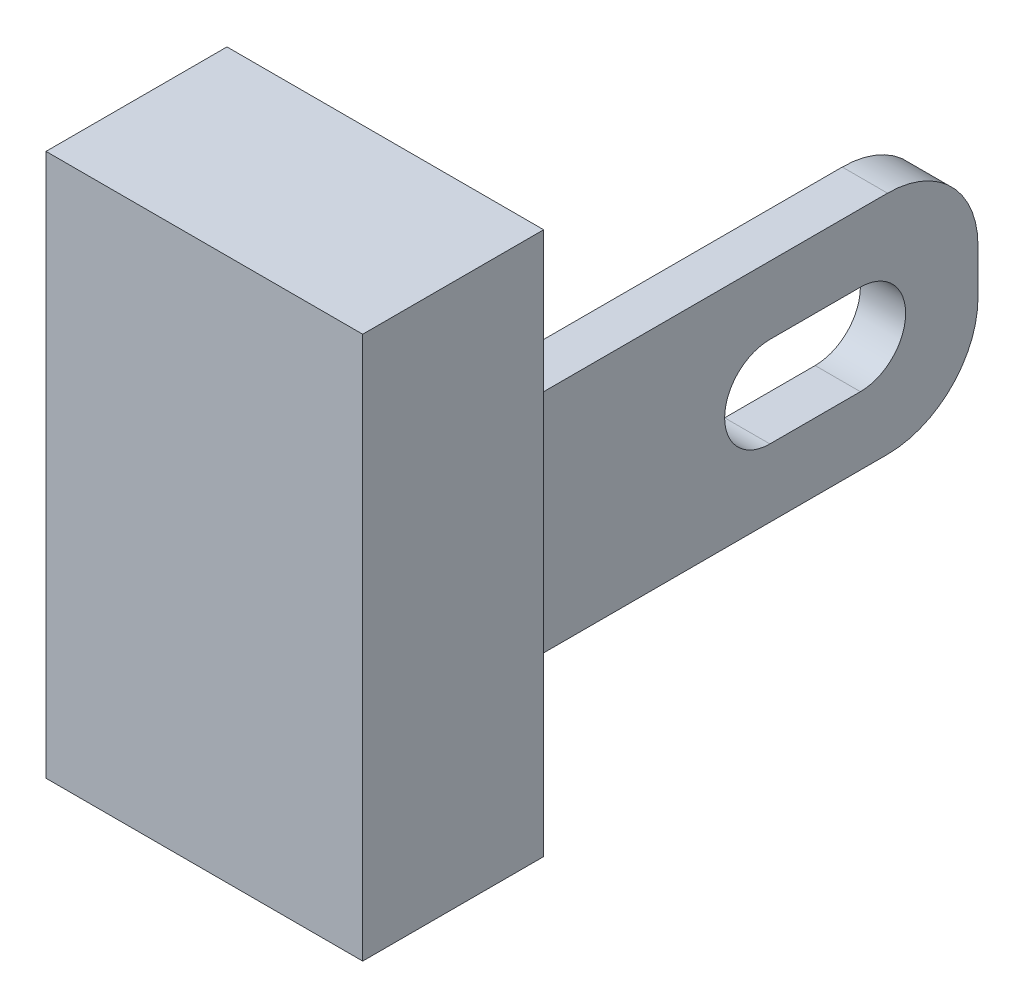
ISO-10303-21;
HEADER;
FILE_DESCRIPTION(('STEP AP214'),'2;1');
FILE_NAME('part.step','',(''),(''),'','','');
FILE_SCHEMA(('AUTOMOTIVE_DESIGN { 1 0 10303 214 1 1 1 1 }'));
ENDSEC;
DATA;
#1=APPLICATION_CONTEXT('core data for automotive mechanical design processes');
#2=APPLICATION_PROTOCOL_DEFINITION('international standard','automotive_design',2000,#1);
#3=PRODUCT_CONTEXT('',#1,'mechanical');
#4=PRODUCT('Part','Part','',(#3));
#5=PRODUCT_RELATED_PRODUCT_CATEGORY('part','',(#4));
#6=PRODUCT_DEFINITION_FORMATION('','',#4);
#7=PRODUCT_DEFINITION_CONTEXT('part definition',#1,'design');
#8=PRODUCT_DEFINITION('design','',#6,#7);
#9=PRODUCT_DEFINITION_SHAPE('','',#8);
#10=(LENGTH_UNIT() NAMED_UNIT(*) SI_UNIT(.MILLI.,.METRE.));
#11=(NAMED_UNIT(*) PLANE_ANGLE_UNIT() SI_UNIT($,.RADIAN.));
#12=(NAMED_UNIT(*) SI_UNIT($,.STERADIAN.) SOLID_ANGLE_UNIT());
#13=UNCERTAINTY_MEASURE_WITH_UNIT(LENGTH_MEASURE(1.E-05),#10,'distance_accuracy_value','');
#14=(GEOMETRIC_REPRESENTATION_CONTEXT(3) GLOBAL_UNCERTAINTY_ASSIGNED_CONTEXT((#13)) GLOBAL_UNIT_ASSIGNED_CONTEXT((#10,
#11,#12)) REPRESENTATION_CONTEXT('',''));
#15=CARTESIAN_POINT('',(0.,0.,0.));
#16=DIRECTION('',(0.,0.,1.));
#17=DIRECTION('',(1.,0.,0.));
#18=AXIS2_PLACEMENT_3D('',#15,#16,#17);
#19=CARTESIAN_POINT('',(0.,0.,0.));
#20=DIRECTION('',(0.,0.,1.));
#21=DIRECTION('',(1.,0.,0.));
#22=AXIS2_PLACEMENT_3D('',#19,#20,#21);
#23=PLANE('',#22);
#24=DIRECTION('',(0.,1.,0.));
#25=VECTOR('',#24,1.);
#26=CARTESIAN_POINT('',(1.75,3.,0.));
#27=LINE('',#26,#25);
#28=CARTESIAN_POINT('',(1.75,-3.,0.));
#29=VERTEX_POINT('',#28);
#30=CARTESIAN_POINT('',(1.75,3.,0.));
#31=VERTEX_POINT('',#30);
#32=EDGE_CURVE('E200',#29,#31,#27,.T.);
#33=ORIENTED_EDGE('',*,*,#32,.F.);
#34=DIRECTION('',(1.,0.,0.));
#35=VECTOR('',#34,1.);
#36=CARTESIAN_POINT('',(-1.75,-3.,0.));
#37=LINE('',#36,#35);
#38=CARTESIAN_POINT('',(-1.75,-3.,0.));
#39=VERTEX_POINT('',#38);
#40=EDGE_CURVE('E205',#39,#29,#37,.T.);
#41=ORIENTED_EDGE('',*,*,#40,.F.);
#42=DIRECTION('',(0.,-1.,0.));
#43=VECTOR('',#42,1.);
#44=CARTESIAN_POINT('',(-1.75,3.,0.));
#45=LINE('',#44,#43);
#46=CARTESIAN_POINT('',(-1.75,3.,0.));
#47=VERTEX_POINT('',#46);
#48=EDGE_CURVE('E216',#47,#39,#45,.T.);
#49=ORIENTED_EDGE('',*,*,#48,.F.);
#50=DIRECTION('',(-1.,0.,0.));
#51=VECTOR('',#50,1.);
#52=CARTESIAN_POINT('',(-1.75,3.,0.));
#53=LINE('',#52,#51);
#54=EDGE_CURVE('E214',#31,#47,#53,.T.);
#55=ORIENTED_EDGE('',*,*,#54,.F.);
#56=EDGE_LOOP('',(#33,#41,#49,#55));
#57=FACE_BOUND('',#56,.T.);
#58=DIRECTION('',(0.,1.,0.));
#59=VECTOR('',#58,1.);
#60=CARTESIAN_POINT('',(1.05,1.25,0.));
#61=LINE('',#60,#59);
#62=CARTESIAN_POINT('',(1.05,-1.25,0.));
#63=VERTEX_POINT('',#62);
#64=CARTESIAN_POINT('',(1.05,1.25,0.));
#65=VERTEX_POINT('',#64);
#66=EDGE_CURVE('E174',#63,#65,#61,.T.);
#67=ORIENTED_EDGE('',*,*,#66,.F.);
#68=DIRECTION('',(-1.,0.,0.));
#69=VECTOR('',#68,1.);
#70=CARTESIAN_POINT('',(1.55,-1.25,0.));
#71=LINE('',#70,#69);
#72=CARTESIAN_POINT('',(1.55,-1.25,0.));
#73=VERTEX_POINT('',#72);
#74=EDGE_CURVE('E179',#73,#63,#71,.T.);
#75=ORIENTED_EDGE('',*,*,#74,.F.);
#76=DIRECTION('',(0.,-1.,0.));
#77=VECTOR('',#76,1.);
#78=CARTESIAN_POINT('',(1.55,1.25,0.));
#79=LINE('',#78,#77);
#80=CARTESIAN_POINT('',(1.55,1.25,0.));
#81=VERTEX_POINT('',#80);
#82=EDGE_CURVE('E188',#81,#73,#79,.T.);
#83=ORIENTED_EDGE('',*,*,#82,.F.);
#84=DIRECTION('',(1.,0.,0.));
#85=VECTOR('',#84,1.);
#86=CARTESIAN_POINT('',(1.55,1.25,0.));
#87=LINE('',#86,#85);
#88=EDGE_CURVE('E185',#65,#81,#87,.T.);
#89=ORIENTED_EDGE('',*,*,#88,.F.);
#90=EDGE_LOOP('',(#67,#75,#83,#89));
#91=FACE_BOUND('',#90,.T.);
#92=ADVANCED_FACE('F37',(#57,#91),#23,.F.);
#93=CARTESIAN_POINT('',(1.75,3.,2.));
#94=DIRECTION('',(-1.,0.,0.));
#95=DIRECTION('',(0.,-1.,0.));
#96=AXIS2_PLACEMENT_3D('',#93,#94,#95);
#97=PLANE('',#96);
#98=ORIENTED_EDGE('',*,*,#32,.T.);
#99=DIRECTION('',(0.,0.,-1.));
#100=VECTOR('',#99,1.);
#101=CARTESIAN_POINT('',(1.75,3.,2.));
#102=LINE('',#101,#100);
#103=CARTESIAN_POINT('',(1.75,3.,2.));
#104=VERTEX_POINT('',#103);
#105=EDGE_CURVE('E227',#104,#31,#102,.T.);
#106=ORIENTED_EDGE('',*,*,#105,.F.);
#107=DIRECTION('',(0.,1.,0.));
#108=VECTOR('',#107,1.);
#109=CARTESIAN_POINT('',(1.75,3.,2.));
#110=LINE('',#109,#108);
#111=CARTESIAN_POINT('',(1.75,-3.,2.));
#112=VERTEX_POINT('',#111);
#113=EDGE_CURVE('E201',#112,#104,#110,.T.);
#114=ORIENTED_EDGE('',*,*,#113,.F.);
#115=DIRECTION('',(0.,0.,-1.));
#116=VECTOR('',#115,1.);
#117=CARTESIAN_POINT('',(1.75,-3.,2.));
#118=LINE('',#117,#116);
#119=EDGE_CURVE('E211',#112,#29,#118,.T.);
#120=ORIENTED_EDGE('',*,*,#119,.T.);
#121=EDGE_LOOP('',(#98,#106,#114,#120));
#122=FACE_BOUND('',#121,.T.);
#123=ADVANCED_FACE('F280',(#122),#97,.F.);
#124=CARTESIAN_POINT('',(-1.75,3.,2.));
#125=DIRECTION('',(0.,-1.,0.));
#126=DIRECTION('',(0.,0.,-1.));
#127=AXIS2_PLACEMENT_3D('',#124,#125,#126);
#128=PLANE('',#127);
#129=ORIENTED_EDGE('',*,*,#54,.T.);
#130=DIRECTION('',(0.,0.,-1.));
#131=VECTOR('',#130,1.);
#132=CARTESIAN_POINT('',(-1.75,3.,2.));
#133=LINE('',#132,#131);
#134=CARTESIAN_POINT('',(-1.75,3.,2.));
#135=VERTEX_POINT('',#134);
#136=EDGE_CURVE('E224',#135,#47,#133,.T.);
#137=ORIENTED_EDGE('',*,*,#136,.F.);
#138=DIRECTION('',(-1.,0.,0.));
#139=VECTOR('',#138,1.);
#140=CARTESIAN_POINT('',(-1.75,3.,2.));
#141=LINE('',#140,#139);
#142=EDGE_CURVE('E204',#104,#135,#141,.T.);
#143=ORIENTED_EDGE('',*,*,#142,.F.);
#144=ORIENTED_EDGE('',*,*,#105,.T.);
#145=EDGE_LOOP('',(#129,#137,#143,#144));
#146=FACE_BOUND('',#145,.T.);
#147=ADVANCED_FACE('F286',(#146),#128,.F.);
#148=CARTESIAN_POINT('',(-1.75,3.,2.));
#149=DIRECTION('',(1.,0.,0.));
#150=DIRECTION('',(0.,1.,0.));
#151=AXIS2_PLACEMENT_3D('',#148,#149,#150);
#152=PLANE('',#151);
#153=ORIENTED_EDGE('',*,*,#48,.T.);
#154=DIRECTION('',(0.,0.,-1.));
#155=VECTOR('',#154,1.);
#156=CARTESIAN_POINT('',(-1.75,-3.,2.));
#157=LINE('',#156,#155);
#158=CARTESIAN_POINT('',(-1.75,-3.,2.));
#159=VERTEX_POINT('',#158);
#160=EDGE_CURVE('E221',#159,#39,#157,.T.);
#161=ORIENTED_EDGE('',*,*,#160,.F.);
#162=DIRECTION('',(0.,-1.,0.));
#163=VECTOR('',#162,1.);
#164=CARTESIAN_POINT('',(-1.75,3.,2.));
#165=LINE('',#164,#163);
#166=EDGE_CURVE('E207',#135,#159,#165,.T.);
#167=ORIENTED_EDGE('',*,*,#166,.F.);
#168=ORIENTED_EDGE('',*,*,#136,.T.);
#169=EDGE_LOOP('',(#153,#161,#167,#168));
#170=FACE_BOUND('',#169,.T.);
#171=ADVANCED_FACE('F297',(#170),#152,.F.);
#172=CARTESIAN_POINT('',(-1.75,-3.,2.));
#173=DIRECTION('',(0.,1.,0.));
#174=DIRECTION('',(0.,0.,1.));
#175=AXIS2_PLACEMENT_3D('',#172,#173,#174);
#176=PLANE('',#175);
#177=ORIENTED_EDGE('',*,*,#40,.T.);
#178=ORIENTED_EDGE('',*,*,#119,.F.);
#179=DIRECTION('',(1.,0.,0.));
#180=VECTOR('',#179,1.);
#181=CARTESIAN_POINT('',(-1.75,-3.,2.));
#182=LINE('',#181,#180);
#183=EDGE_CURVE('E209',#159,#112,#182,.T.);
#184=ORIENTED_EDGE('',*,*,#183,.F.);
#185=ORIENTED_EDGE('',*,*,#160,.T.);
#186=EDGE_LOOP('',(#177,#178,#184,#185));
#187=FACE_BOUND('',#186,.T.);
#188=ADVANCED_FACE('F294',(#187),#176,.F.);
#189=CARTESIAN_POINT('',(0.,0.,2.));
#190=DIRECTION('',(0.,0.,1.));
#191=DIRECTION('',(1.,0.,0.));
#192=AXIS2_PLACEMENT_3D('',#189,#190,#191);
#193=PLANE('',#192);
#194=ORIENTED_EDGE('',*,*,#113,.T.);
#195=ORIENTED_EDGE('',*,*,#142,.T.);
#196=ORIENTED_EDGE('',*,*,#166,.T.);
#197=ORIENTED_EDGE('',*,*,#183,.T.);
#198=EDGE_LOOP('',(#194,#195,#196,#197));
#199=FACE_BOUND('',#198,.T.);
#200=ADVANCED_FACE('F292',(#199),#193,.T.);
#201=CARTESIAN_POINT('',(1.05,1.25,-5.));
#202=DIRECTION('',(1.,0.,0.));
#203=DIRECTION('',(0.,1.,0.));
#204=AXIS2_PLACEMENT_3D('',#201,#202,#203);
#205=PLANE('',#204);
#206=DIRECTION('',(0.,0.,1.));
#207=VECTOR('',#206,1.);
#208=CARTESIAN_POINT('',(1.05,0.5,-5.));
#209=LINE('',#208,#207);
#210=CARTESIAN_POINT('',(1.05,0.5,-3.7));
#211=VERTEX_POINT('',#210);
#212=CARTESIAN_POINT('',(1.05,0.5,-2.7));
#213=VERTEX_POINT('',#212);
#214=EDGE_CURVE('E168',#211,#213,#209,.T.);
#215=ORIENTED_EDGE('',*,*,#214,.T.);
#216=CARTESIAN_POINT('',(1.05,0.,-2.7));
#217=DIRECTION('',(1.,0.,0.));
#218=DIRECTION('',(0.,1.,0.));
#219=AXIS2_PLACEMENT_3D('',#216,#217,#218);
#220=CIRCLE('',#219,0.5);
#221=CARTESIAN_POINT('',(1.05,-0.5,-2.7));
#222=VERTEX_POINT('',#221);
#223=EDGE_CURVE('E171',#213,#222,#220,.T.);
#224=ORIENTED_EDGE('',*,*,#223,.T.);
#225=DIRECTION('',(0.,0.,-1.));
#226=VECTOR('',#225,1.);
#227=CARTESIAN_POINT('',(1.05,-0.5,-5.));
#228=LINE('',#227,#226);
#229=CARTESIAN_POINT('',(1.05,-0.5,-3.7));
#230=VERTEX_POINT('',#229);
#231=EDGE_CURVE('E163',#222,#230,#228,.T.);
#232=ORIENTED_EDGE('',*,*,#231,.T.);
#233=CARTESIAN_POINT('',(1.05,0.,-3.7));
#234=DIRECTION('',(1.,0.,0.));
#235=DIRECTION('',(0.,1.,0.));
#236=AXIS2_PLACEMENT_3D('',#233,#234,#235);
#237=CIRCLE('',#236,0.5);
#238=EDGE_CURVE('E143',#230,#211,#237,.T.);
#239=ORIENTED_EDGE('',*,*,#238,.T.);
#240=EDGE_LOOP('',(#215,#224,#232,#239));
#241=FACE_BOUND('',#240,.T.);
#242=DIRECTION('',(0.,1.,0.));
#243=VECTOR('',#242,1.);
#244=CARTESIAN_POINT('',(1.05,1.25,-5.));
#245=LINE('',#244,#243);
#246=CARTESIAN_POINT('',(1.05,-0.25,-5.));
#247=VERTEX_POINT('',#246);
#248=CARTESIAN_POINT('',(1.05,0.25,-5.));
#249=VERTEX_POINT('',#248);
#250=EDGE_CURVE('E175',#247,#249,#245,.T.);
#251=ORIENTED_EDGE('',*,*,#250,.F.);
#252=CARTESIAN_POINT('',(1.05,-0.25,-4.));
#253=DIRECTION('',(1.,0.,0.));
#254=DIRECTION('',(0.,1.,0.));
#255=AXIS2_PLACEMENT_3D('',#252,#253,#254);
#256=CIRCLE('',#255,1.);
#257=CARTESIAN_POINT('',(1.05,-1.25,-4.));
#258=VERTEX_POINT('',#257);
#259=EDGE_CURVE('E238',#247,#258,#256,.F.);
#260=ORIENTED_EDGE('',*,*,#259,.T.);
#261=DIRECTION('',(0.,0.,1.));
#262=VECTOR('',#261,1.);
#263=CARTESIAN_POINT('',(1.05,-1.25,-5.));
#264=LINE('',#263,#262);
#265=EDGE_CURVE('E182',#258,#63,#264,.T.);
#266=ORIENTED_EDGE('',*,*,#265,.T.);
#267=ORIENTED_EDGE('',*,*,#66,.T.);
#268=DIRECTION('',(0.,0.,1.));
#269=VECTOR('',#268,1.);
#270=CARTESIAN_POINT('',(1.05,1.25,-5.));
#271=LINE('',#270,#269);
#272=CARTESIAN_POINT('',(1.05,1.25,-4.));
#273=VERTEX_POINT('',#272);
#274=EDGE_CURVE('E198',#273,#65,#271,.T.);
#275=ORIENTED_EDGE('',*,*,#274,.F.);
#276=CARTESIAN_POINT('',(1.05,0.25,-4.));
#277=DIRECTION('',(1.,0.,0.));
#278=DIRECTION('',(0.,1.,0.));
#279=AXIS2_PLACEMENT_3D('',#276,#277,#278);
#280=CIRCLE('',#279,1.);
#281=EDGE_CURVE('E236',#273,#249,#280,.F.);
#282=ORIENTED_EDGE('',*,*,#281,.T.);
#283=EDGE_LOOP('',(#251,#260,#266,#267,#275,#282));
#284=FACE_BOUND('',#283,.T.);
#285=ADVANCED_FACE('F256',(#241,#284),#205,.F.);
#286=CARTESIAN_POINT('',(1.55,1.25,-5.));
#287=DIRECTION('',(0.,-1.,0.));
#288=DIRECTION('',(1.,0.,0.));
#289=AXIS2_PLACEMENT_3D('',#286,#287,#288);
#290=PLANE('',#289);
#291=DIRECTION('',(0.,0.,1.));
#292=VECTOR('',#291,1.);
#293=CARTESIAN_POINT('',(1.55,1.25,-5.));
#294=LINE('',#293,#292);
#295=CARTESIAN_POINT('',(1.55,1.25,-4.));
#296=VERTEX_POINT('',#295);
#297=EDGE_CURVE('E196',#296,#81,#294,.T.);
#298=ORIENTED_EDGE('',*,*,#297,.F.);
#299=DIRECTION('',(1.,0.,0.));
#300=VECTOR('',#299,1.);
#301=CARTESIAN_POINT('',(1.05,1.25,-4.));
#302=LINE('',#301,#300);
#303=EDGE_CURVE('E11',#296,#273,#302,.F.);
#304=ORIENTED_EDGE('',*,*,#303,.T.);
#305=ORIENTED_EDGE('',*,*,#274,.T.);
#306=ORIENTED_EDGE('',*,*,#88,.T.);
#307=EDGE_LOOP('',(#298,#304,#305,#306));
#308=FACE_BOUND('',#307,.T.);
#309=ADVANCED_FACE('F267',(#308),#290,.F.);
#310=CARTESIAN_POINT('',(1.55,1.25,-5.));
#311=DIRECTION('',(-1.,0.,0.));
#312=DIRECTION('',(0.,-1.,0.));
#313=AXIS2_PLACEMENT_3D('',#310,#311,#312);
#314=PLANE('',#313);
#315=DIRECTION('',(0.,0.,-1.));
#316=VECTOR('',#315,1.);
#317=CARTESIAN_POINT('',(1.55,-0.5,-2.7));
#318=LINE('',#317,#316);
#319=CARTESIAN_POINT('',(1.55,-0.5,-2.7));
#320=VERTEX_POINT('',#319);
#321=CARTESIAN_POINT('',(1.55,-0.5,-3.7));
#322=VERTEX_POINT('',#321);
#323=EDGE_CURVE('E149',#320,#322,#318,.T.);
#324=ORIENTED_EDGE('',*,*,#323,.F.);
#325=CARTESIAN_POINT('',(1.55,0.,-2.7));
#326=DIRECTION('',(1.,0.,0.));
#327=DIRECTION('',(0.,1.,0.));
#328=AXIS2_PLACEMENT_3D('',#325,#326,#327);
#329=CIRCLE('',#328,0.5);
#330=CARTESIAN_POINT('',(1.55,0.5,-2.7));
#331=VERTEX_POINT('',#330);
#332=EDGE_CURVE('E60',#331,#320,#329,.T.);
#333=ORIENTED_EDGE('',*,*,#332,.F.);
#334=DIRECTION('',(0.,0.,1.));
#335=VECTOR('',#334,1.);
#336=CARTESIAN_POINT('',(1.55,0.5,-2.7));
#337=LINE('',#336,#335);
#338=CARTESIAN_POINT('',(1.55,0.5,-3.7));
#339=VERTEX_POINT('',#338);
#340=EDGE_CURVE('E156',#339,#331,#337,.T.);
#341=ORIENTED_EDGE('',*,*,#340,.F.);
#342=CARTESIAN_POINT('',(1.55,0.,-3.7));
#343=DIRECTION('',(1.,0.,0.));
#344=DIRECTION('',(0.,1.,0.));
#345=AXIS2_PLACEMENT_3D('',#342,#343,#344);
#346=CIRCLE('',#345,0.5);
#347=EDGE_CURVE('E140',#322,#339,#346,.T.);
#348=ORIENTED_EDGE('',*,*,#347,.F.);
#349=EDGE_LOOP('',(#324,#333,#341,#348));
#350=FACE_BOUND('',#349,.T.);
#351=DIRECTION('',(0.,0.,1.));
#352=VECTOR('',#351,1.);
#353=CARTESIAN_POINT('',(1.55,-1.25,-5.));
#354=LINE('',#353,#352);
#355=CARTESIAN_POINT('',(1.55,-1.25,-4.));
#356=VERTEX_POINT('',#355);
#357=EDGE_CURVE('E194',#356,#73,#354,.T.);
#358=ORIENTED_EDGE('',*,*,#357,.F.);
#359=CARTESIAN_POINT('',(1.55,-0.25,-4.));
#360=DIRECTION('',(-1.,0.,0.));
#361=DIRECTION('',(0.,-1.,0.));
#362=AXIS2_PLACEMENT_3D('',#359,#360,#361);
#363=CIRCLE('',#362,1.);
#364=CARTESIAN_POINT('',(1.55,-0.25,-5.));
#365=VERTEX_POINT('',#364);
#366=EDGE_CURVE('E45',#356,#365,#363,.F.);
#367=ORIENTED_EDGE('',*,*,#366,.T.);
#368=DIRECTION('',(0.,-1.,0.));
#369=VECTOR('',#368,1.);
#370=CARTESIAN_POINT('',(1.55,1.25,-5.));
#371=LINE('',#370,#369);
#372=CARTESIAN_POINT('',(1.55,0.25,-5.));
#373=VERTEX_POINT('',#372);
#374=EDGE_CURVE('E178',#373,#365,#371,.T.);
#375=ORIENTED_EDGE('',*,*,#374,.F.);
#376=CARTESIAN_POINT('',(1.55,0.25,-4.));
#377=DIRECTION('',(-1.,0.,0.));
#378=DIRECTION('',(0.,-1.,0.));
#379=AXIS2_PLACEMENT_3D('',#376,#377,#378);
#380=CIRCLE('',#379,1.);
#381=EDGE_CURVE('E242',#373,#296,#380,.F.);
#382=ORIENTED_EDGE('',*,*,#381,.T.);
#383=ORIENTED_EDGE('',*,*,#297,.T.);
#384=ORIENTED_EDGE('',*,*,#82,.T.);
#385=EDGE_LOOP('',(#358,#367,#375,#382,#383,#384));
#386=FACE_BOUND('',#385,.T.);
#387=ADVANCED_FACE('F153',(#350,#386),#314,.F.);
#388=CARTESIAN_POINT('',(1.55,-1.25,-5.));
#389=DIRECTION('',(0.,1.,0.));
#390=DIRECTION('',(0.,0.,1.));
#391=AXIS2_PLACEMENT_3D('',#388,#389,#390);
#392=PLANE('',#391);
#393=ORIENTED_EDGE('',*,*,#265,.F.);
#394=DIRECTION('',(-1.,0.,0.));
#395=VECTOR('',#394,1.);
#396=CARTESIAN_POINT('',(1.55,-1.25,-4.));
#397=LINE('',#396,#395);
#398=EDGE_CURVE('E240',#258,#356,#397,.F.);
#399=ORIENTED_EDGE('',*,*,#398,.T.);
#400=ORIENTED_EDGE('',*,*,#357,.T.);
#401=ORIENTED_EDGE('',*,*,#74,.T.);
#402=EDGE_LOOP('',(#393,#399,#400,#401));
#403=FACE_BOUND('',#402,.T.);
#404=ADVANCED_FACE('F259',(#403),#392,.F.);
#405=CARTESIAN_POINT('',(0.,0.,-5.));
#406=DIRECTION('',(0.,0.,-1.));
#407=DIRECTION('',(-1.,0.,0.));
#408=AXIS2_PLACEMENT_3D('',#405,#406,#407);
#409=PLANE('',#408);
#410=ORIENTED_EDGE('',*,*,#374,.T.);
#411=DIRECTION('',(-1.,0.,0.));
#412=VECTOR('',#411,1.);
#413=CARTESIAN_POINT('',(1.05,-0.25,-5.));
#414=LINE('',#413,#412);
#415=EDGE_CURVE('E233',#365,#247,#414,.T.);
#416=ORIENTED_EDGE('',*,*,#415,.T.);
#417=ORIENTED_EDGE('',*,*,#250,.T.);
#418=DIRECTION('',(1.,0.,0.));
#419=VECTOR('',#418,1.);
#420=CARTESIAN_POINT('',(1.55,0.25,-5.));
#421=LINE('',#420,#419);
#422=EDGE_CURVE('E230',#249,#373,#421,.T.);
#423=ORIENTED_EDGE('',*,*,#422,.T.);
#424=EDGE_LOOP('',(#410,#416,#417,#423));
#425=FACE_BOUND('',#424,.T.);
#426=ADVANCED_FACE('F250',(#425),#409,.T.);
#427=CARTESIAN_POINT('',(0.,-0.25,-4.));
#428=DIRECTION('',(1.,0.,0.));
#429=DIRECTION('',(0.,0.,-1.));
#430=AXIS2_PLACEMENT_3D('',#427,#428,#429);
#431=CYLINDRICAL_SURFACE('',#430,1.);
#432=ORIENTED_EDGE('',*,*,#366,.F.);
#433=ORIENTED_EDGE('',*,*,#398,.F.);
#434=ORIENTED_EDGE('',*,*,#259,.F.);
#435=ORIENTED_EDGE('',*,*,#415,.F.);
#436=EDGE_LOOP('',(#432,#433,#434,#435));
#437=FACE_BOUND('',#436,.T.);
#438=ADVANCED_FACE('F253',(#437),#431,.T.);
#439=CARTESIAN_POINT('',(0.,0.249999999999999,-4.));
#440=DIRECTION('',(-1.,0.,0.));
#441=DIRECTION('',(0.,-1.,0.));
#442=AXIS2_PLACEMENT_3D('',#439,#440,#441);
#443=CYLINDRICAL_SURFACE('',#442,1.);
#444=ORIENTED_EDGE('',*,*,#281,.F.);
#445=ORIENTED_EDGE('',*,*,#303,.F.);
#446=ORIENTED_EDGE('',*,*,#381,.F.);
#447=ORIENTED_EDGE('',*,*,#422,.F.);
#448=EDGE_LOOP('',(#444,#445,#446,#447));
#449=FACE_BOUND('',#448,.T.);
#450=ADVANCED_FACE('F39',(#449),#443,.T.);
#451=CARTESIAN_POINT('',(-1.75,0.,-2.7));
#452=DIRECTION('',(1.,0.,0.));
#453=DIRECTION('',(0.,1.,0.));
#454=AXIS2_PLACEMENT_3D('',#451,#452,#453);
#455=CYLINDRICAL_SURFACE('',#454,0.5);
#456=DIRECTION('',(1.,0.,0.));
#457=VECTOR('',#456,1.);
#458=CARTESIAN_POINT('',(-1.75,0.5,-2.7));
#459=LINE('',#458,#457);
#460=EDGE_CURVE('E161',#213,#331,#459,.T.);
#461=ORIENTED_EDGE('',*,*,#460,.T.);
#462=ORIENTED_EDGE('',*,*,#332,.T.);
#463=DIRECTION('',(1.,0.,0.));
#464=VECTOR('',#463,1.);
#465=CARTESIAN_POINT('',(-1.75,-0.5,-2.7));
#466=LINE('',#465,#464);
#467=EDGE_CURVE('E146',#222,#320,#466,.T.);
#468=ORIENTED_EDGE('',*,*,#467,.F.);
#469=ORIENTED_EDGE('',*,*,#223,.F.);
#470=EDGE_LOOP('',(#461,#462,#468,#469));
#471=FACE_BOUND('',#470,.T.);
#472=ADVANCED_FACE('F272',(#471),#455,.F.);
#473=CARTESIAN_POINT('',(-1.75,0.5,-2.7));
#474=DIRECTION('',(0.,1.,0.));
#475=DIRECTION('',(-1.,0.,0.));
#476=AXIS2_PLACEMENT_3D('',#473,#474,#475);
#477=PLANE('',#476);
#478=DIRECTION('',(1.,0.,0.));
#479=VECTOR('',#478,1.);
#480=CARTESIAN_POINT('',(-1.75,0.5,-3.7));
#481=LINE('',#480,#479);
#482=EDGE_CURVE('E145',#211,#339,#481,.T.);
#483=ORIENTED_EDGE('',*,*,#482,.T.);
#484=ORIENTED_EDGE('',*,*,#340,.T.);
#485=ORIENTED_EDGE('',*,*,#460,.F.);
#486=ORIENTED_EDGE('',*,*,#214,.F.);
#487=EDGE_LOOP('',(#483,#484,#485,#486));
#488=FACE_BOUND('',#487,.T.);
#489=ADVANCED_FACE('F277',(#488),#477,.F.);
#490=CARTESIAN_POINT('',(-1.75,0.,-3.7));
#491=DIRECTION('',(1.,0.,0.));
#492=DIRECTION('',(0.,1.,0.));
#493=AXIS2_PLACEMENT_3D('',#490,#491,#492);
#494=CYLINDRICAL_SURFACE('',#493,0.5);
#495=DIRECTION('',(1.,0.,0.));
#496=VECTOR('',#495,1.);
#497=CARTESIAN_POINT('',(-1.75,-0.5,-3.7));
#498=LINE('',#497,#496);
#499=EDGE_CURVE('E52',#230,#322,#498,.T.);
#500=ORIENTED_EDGE('',*,*,#499,.T.);
#501=ORIENTED_EDGE('',*,*,#347,.T.);
#502=ORIENTED_EDGE('',*,*,#482,.F.);
#503=ORIENTED_EDGE('',*,*,#238,.F.);
#504=EDGE_LOOP('',(#500,#501,#502,#503));
#505=FACE_BOUND('',#504,.T.);
#506=ADVANCED_FACE('F137',(#505),#494,.F.);
#507=CARTESIAN_POINT('',(-1.75,-0.5,-2.7));
#508=DIRECTION('',(0.,-1.,0.));
#509=DIRECTION('',(1.,0.,0.));
#510=AXIS2_PLACEMENT_3D('',#507,#508,#509);
#511=PLANE('',#510);
#512=ORIENTED_EDGE('',*,*,#467,.T.);
#513=ORIENTED_EDGE('',*,*,#323,.T.);
#514=ORIENTED_EDGE('',*,*,#499,.F.);
#515=ORIENTED_EDGE('',*,*,#231,.F.);
#516=EDGE_LOOP('',(#512,#513,#514,#515));
#517=FACE_BOUND('',#516,.T.);
#518=ADVANCED_FACE('F150',(#517),#511,.F.);
#519=CLOSED_SHELL('',(#92,#123,#147,#171,#188,#200,#285,#309,#387,#404,#426,#438,#450,#472,#489,
#506,#518));
#520=MANIFOLD_SOLID_BREP('B2',#519);
#521=ADVANCED_BREP_SHAPE_REPRESENTATION('',(#18,#520),#14);
#522=SHAPE_DEFINITION_REPRESENTATION(#9,#521);
ENDSEC;
END-ISO-10303-21;
